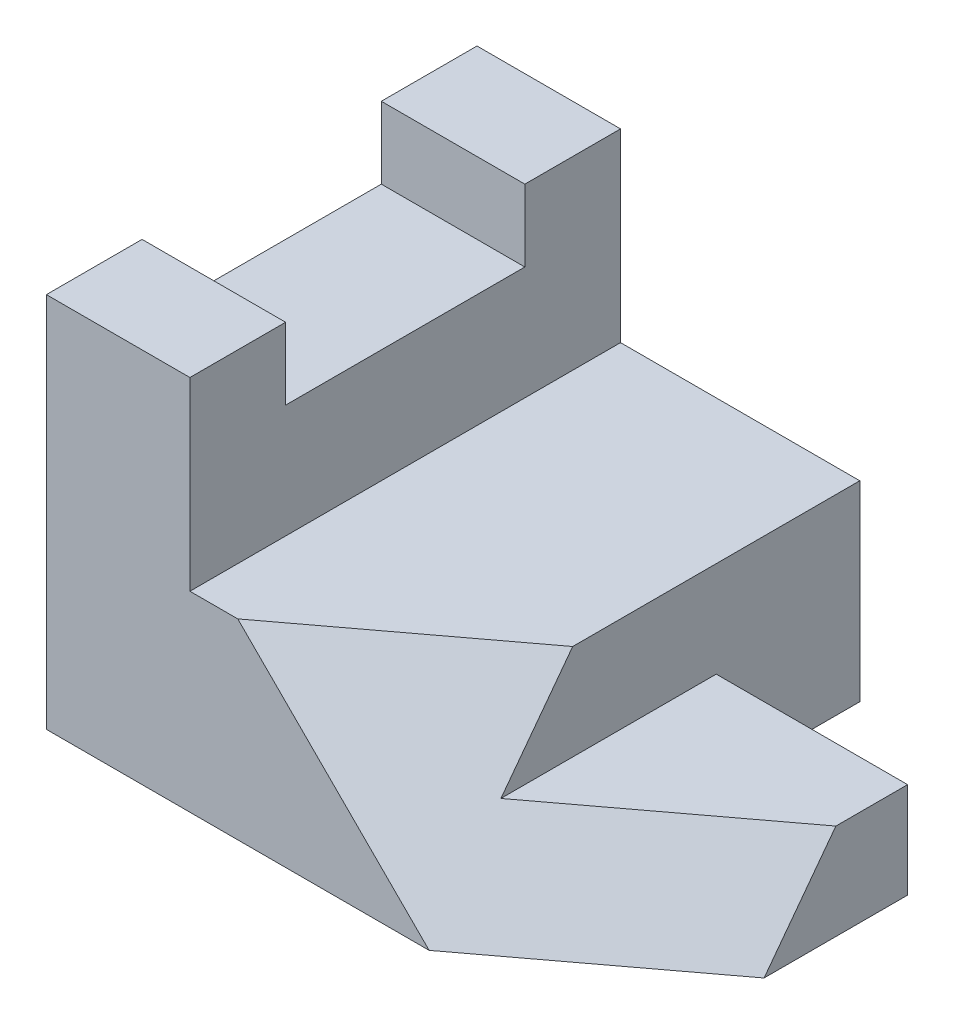
ISO-10303-21;
HEADER;
FILE_DESCRIPTION(('STEP AP214'),'2;1');
FILE_NAME('part.step','',(''),(''),'','','');
FILE_SCHEMA(('AUTOMOTIVE_DESIGN { 1 0 10303 214 1 1 1 1 }'));
ENDSEC;
DATA;
#1=APPLICATION_CONTEXT('core data for automotive mechanical design processes');
#2=APPLICATION_PROTOCOL_DEFINITION('international standard','automotive_design',2000,#1);
#3=PRODUCT_CONTEXT('',#1,'mechanical');
#4=PRODUCT('Part','Part','',(#3));
#5=PRODUCT_RELATED_PRODUCT_CATEGORY('part','',(#4));
#6=PRODUCT_DEFINITION_FORMATION('','',#4);
#7=PRODUCT_DEFINITION_CONTEXT('part definition',#1,'design');
#8=PRODUCT_DEFINITION('design','',#6,#7);
#9=PRODUCT_DEFINITION_SHAPE('','',#8);
#10=(LENGTH_UNIT() NAMED_UNIT(*) SI_UNIT(.MILLI.,.METRE.));
#11=(NAMED_UNIT(*) PLANE_ANGLE_UNIT() SI_UNIT($,.RADIAN.));
#12=(NAMED_UNIT(*) SI_UNIT($,.STERADIAN.) SOLID_ANGLE_UNIT());
#13=UNCERTAINTY_MEASURE_WITH_UNIT(LENGTH_MEASURE(1.E-05),#10,'distance_accuracy_value','');
#14=(GEOMETRIC_REPRESENTATION_CONTEXT(3) GLOBAL_UNCERTAINTY_ASSIGNED_CONTEXT((#13)) GLOBAL_UNIT_ASSIGNED_CONTEXT((#10,
#11,#12)) REPRESENTATION_CONTEXT('',''));
#15=CARTESIAN_POINT('',(0.,0.,0.));
#16=DIRECTION('',(0.,0.,1.));
#17=DIRECTION('',(1.,0.,0.));
#18=AXIS2_PLACEMENT_3D('',#15,#16,#17);
#19=CARTESIAN_POINT('',(50.8,0.,0.));
#20=DIRECTION('',(-1.,0.,0.));
#21=DIRECTION('',(0.,0.,1.));
#22=AXIS2_PLACEMENT_3D('',#19,#20,#21);
#23=PLANE('',#22);
#24=DIRECTION('',(0.,0.8,-0.6));
#25=VECTOR('',#24,1.);
#26=CARTESIAN_POINT('',(50.8,13.716,18.288));
#27=LINE('',#26,#25);
#28=CARTESIAN_POINT('',(50.8,12.7,19.05));
#29=VERTEX_POINT('',#28);
#30=CARTESIAN_POINT('',(50.8,25.4,9.52500000000004));
#31=VERTEX_POINT('',#30);
#32=EDGE_CURVE('E155',#29,#31,#27,.T.);
#33=ORIENTED_EDGE('',*,*,#32,.F.);
#34=DIRECTION('',(0.,0.,1.));
#35=VECTOR('',#34,1.);
#36=CARTESIAN_POINT('',(50.8,12.7,28.575));
#37=LINE('',#36,#35);
#38=CARTESIAN_POINT('',(50.8,12.7,-9.52500000000001));
#39=VERTEX_POINT('',#38);
#40=EDGE_CURVE('E152',#39,#29,#37,.T.);
#41=ORIENTED_EDGE('',*,*,#40,.F.);
#42=DIRECTION('',(0.,1.,0.));
#43=VECTOR('',#42,1.);
#44=CARTESIAN_POINT('',(50.8,0.,-9.52500000000001));
#45=LINE('',#44,#43);
#46=CARTESIAN_POINT('',(50.8,0.,-9.52500000000001));
#47=VERTEX_POINT('',#46);
#48=EDGE_CURVE('E165',#47,#39,#45,.T.);
#49=ORIENTED_EDGE('',*,*,#48,.F.);
#50=DIRECTION('',(0.,0.,-1.));
#51=VECTOR('',#50,1.);
#52=CARTESIAN_POINT('',(50.8,0.,-28.575));
#53=LINE('',#52,#51);
#54=CARTESIAN_POINT('',(50.8,0.,-28.575));
#55=VERTEX_POINT('',#54);
#56=EDGE_CURVE('E184',#47,#55,#53,.T.);
#57=ORIENTED_EDGE('',*,*,#56,.T.);
#58=DIRECTION('',(0.,1.,0.));
#59=VECTOR('',#58,1.);
#60=CARTESIAN_POINT('',(50.8,25.4,-28.575));
#61=LINE('',#60,#59);
#62=CARTESIAN_POINT('',(50.8,25.4,-28.575));
#63=VERTEX_POINT('',#62);
#64=EDGE_CURVE('E186',#55,#63,#61,.T.);
#65=ORIENTED_EDGE('',*,*,#64,.T.);
#66=DIRECTION('',(0.,0.,1.));
#67=VECTOR('',#66,1.);
#68=CARTESIAN_POINT('',(50.8,25.4,28.575));
#69=LINE('',#68,#67);
#70=EDGE_CURVE('E192',#63,#31,#69,.T.);
#71=ORIENTED_EDGE('',*,*,#70,.T.);
#72=EDGE_LOOP('',(#33,#41,#49,#57,#65,#71));
#73=FACE_BOUND('',#72,.T.);
#74=ADVANCED_FACE('F33',(#73),#23,.F.);
#75=CARTESIAN_POINT('',(19.05,49.9683225810123,28.575));
#76=DIRECTION('',(0.,0.,-1.));
#77=DIRECTION('',(0.,1.,0.));
#78=AXIS2_PLACEMENT_3D('',#75,#76,#77);
#79=PLANE('',#78);
#80=DIRECTION('',(0.707106781186547,-0.707106781186548,0.));
#81=VECTOR('',#80,1.);
#82=CARTESIAN_POINT('',(9.94083870949386,40.8591612905062,28.575));
#83=LINE('',#82,#81);
#84=CARTESIAN_POINT('',(25.4000000000001,25.4,28.575));
#85=VERTEX_POINT('',#84);
#86=CARTESIAN_POINT('',(50.8000000000001,0.,28.575));
#87=VERTEX_POINT('',#86);
#88=EDGE_CURVE('E159',#85,#87,#83,.T.);
#89=ORIENTED_EDGE('',*,*,#88,.F.);
#90=DIRECTION('',(-1.,0.,0.));
#91=VECTOR('',#90,1.);
#92=CARTESIAN_POINT('',(50.8,25.4,28.575));
#93=LINE('',#92,#91);
#94=CARTESIAN_POINT('',(19.05,25.4,28.575));
#95=VERTEX_POINT('',#94);
#96=EDGE_CURVE('E37',#85,#95,#93,.T.);
#97=ORIENTED_EDGE('',*,*,#96,.T.);
#98=DIRECTION('',(0.,-1.,0.));
#99=VECTOR('',#98,1.);
#100=CARTESIAN_POINT('',(19.05,49.9683225810123,28.575));
#101=LINE('',#100,#99);
#102=CARTESIAN_POINT('',(19.05,49.9683225810123,28.575));
#103=VERTEX_POINT('',#102);
#104=EDGE_CURVE('E216',#103,#95,#101,.T.);
#105=ORIENTED_EDGE('',*,*,#104,.F.);
#106=DIRECTION('',(-1.,0.,0.));
#107=VECTOR('',#106,1.);
#108=CARTESIAN_POINT('',(19.05,49.9683225810123,28.575));
#109=LINE('',#108,#107);
#110=CARTESIAN_POINT('',(0.,49.9683225810123,28.575));
#111=VERTEX_POINT('',#110);
#112=EDGE_CURVE('E43',#103,#111,#109,.T.);
#113=ORIENTED_EDGE('',*,*,#112,.T.);
#114=DIRECTION('',(0.,-1.,0.));
#115=VECTOR('',#114,1.);
#116=CARTESIAN_POINT('',(0.,49.9683225810123,28.575));
#117=LINE('',#116,#115);
#118=CARTESIAN_POINT('',(0.,0.,28.575));
#119=VERTEX_POINT('',#118);
#120=EDGE_CURVE('E210',#111,#119,#117,.T.);
#121=ORIENTED_EDGE('',*,*,#120,.T.);
#122=DIRECTION('',(-1.,0.,0.));
#123=VECTOR('',#122,1.);
#124=CARTESIAN_POINT('',(19.05,0.,28.575));
#125=LINE('',#124,#123);
#126=EDGE_CURVE('E394',#87,#119,#125,.T.);
#127=ORIENTED_EDGE('',*,*,#126,.F.);
#128=EDGE_LOOP('',(#89,#97,#105,#113,#121,#127));
#129=FACE_BOUND('',#128,.T.);
#130=ADVANCED_FACE('F214',(#129),#79,.F.);
#131=CARTESIAN_POINT('',(19.05,0.,-28.575));
#132=DIRECTION('',(0.,1.,0.));
#133=DIRECTION('',(0.,0.,1.));
#134=AXIS2_PLACEMENT_3D('',#131,#132,#133);
#135=PLANE('',#134);
#136=DIRECTION('',(0.8,0.,-0.6));
#137=VECTOR('',#136,1.);
#138=CARTESIAN_POINT('',(-94.861231383918,0.,137.820923537939));
#139=LINE('',#138,#137);
#140=CARTESIAN_POINT('',(76.2,0.,9.52500000000004));
#141=VERTEX_POINT('',#140);
#142=EDGE_CURVE('E50',#87,#141,#139,.T.);
#143=ORIENTED_EDGE('',*,*,#142,.F.);
#144=ORIENTED_EDGE('',*,*,#126,.T.);
#145=DIRECTION('',(0.,0.,-1.));
#146=VECTOR('',#145,1.);
#147=CARTESIAN_POINT('',(0.,0.,-28.575));
#148=LINE('',#147,#146);
#149=CARTESIAN_POINT('',(0.,0.,-28.575));
#150=VERTEX_POINT('',#149);
#151=EDGE_CURVE('E392',#119,#150,#148,.T.);
#152=ORIENTED_EDGE('',*,*,#151,.T.);
#153=DIRECTION('',(-1.,0.,0.));
#154=VECTOR('',#153,1.);
#155=CARTESIAN_POINT('',(19.05,0.,-28.575));
#156=LINE('',#155,#154);
#157=EDGE_CURVE('E396',#55,#150,#156,.T.);
#158=ORIENTED_EDGE('',*,*,#157,.F.);
#159=ORIENTED_EDGE('',*,*,#56,.F.);
#160=DIRECTION('',(-1.,0.,0.));
#161=VECTOR('',#160,1.);
#162=CARTESIAN_POINT('',(76.2,0.,-9.52500000000001));
#163=LINE('',#162,#161);
#164=CARTESIAN_POINT('',(76.2,0.,-9.52500000000001));
#165=VERTEX_POINT('',#164);
#166=EDGE_CURVE('E176',#165,#47,#163,.T.);
#167=ORIENTED_EDGE('',*,*,#166,.F.);
#168=DIRECTION('',(0.,0.,-1.));
#169=VECTOR('',#168,1.);
#170=CARTESIAN_POINT('',(76.2,0.,28.575));
#171=LINE('',#170,#169);
#172=EDGE_CURVE('E166',#141,#165,#171,.T.);
#173=ORIENTED_EDGE('',*,*,#172,.F.);
#174=EDGE_LOOP('',(#143,#144,#152,#158,#159,#167,#173));
#175=FACE_BOUND('',#174,.T.);
#176=ADVANCED_FACE('F225',(#175),#135,.F.);
#177=CARTESIAN_POINT('',(50.8,25.4,28.575));
#178=DIRECTION('',(0.,-1.,0.));
#179=DIRECTION('',(0.,0.,-1.));
#180=AXIS2_PLACEMENT_3D('',#177,#178,#179);
#181=PLANE('',#180);
#182=DIRECTION('',(0.8,0.,-0.6));
#183=VECTOR('',#182,1.);
#184=CARTESIAN_POINT('',(-120.261231383918,25.4,137.820923537939));
#185=LINE('',#184,#183);
#186=EDGE_CURVE('E58',#85,#31,#185,.T.);
#187=ORIENTED_EDGE('',*,*,#186,.T.);
#188=ORIENTED_EDGE('',*,*,#70,.F.);
#189=DIRECTION('',(-1.,0.,0.));
#190=VECTOR('',#189,1.);
#191=CARTESIAN_POINT('',(50.8,25.4,-28.575));
#192=LINE('',#191,#190);
#193=CARTESIAN_POINT('',(19.05,25.4,-28.575));
#194=VERTEX_POINT('',#193);
#195=EDGE_CURVE('E205',#63,#194,#192,.T.);
#196=ORIENTED_EDGE('',*,*,#195,.T.);
#197=DIRECTION('',(0.,0.,1.));
#198=VECTOR('',#197,1.);
#199=CARTESIAN_POINT('',(19.05,25.4,28.575));
#200=LINE('',#199,#198);
#201=EDGE_CURVE('E179',#194,#95,#200,.T.);
#202=ORIENTED_EDGE('',*,*,#201,.T.);
#203=ORIENTED_EDGE('',*,*,#96,.F.);
#204=EDGE_LOOP('',(#187,#188,#196,#202,#203));
#205=FACE_BOUND('',#204,.T.);
#206=ADVANCED_FACE('F223',(#205),#181,.F.);
#207=CARTESIAN_POINT('',(76.2,12.7,28.575));
#208=DIRECTION('',(0.,-1.,0.));
#209=DIRECTION('',(0.,0.,-1.));
#210=AXIS2_PLACEMENT_3D('',#207,#208,#209);
#211=PLANE('',#210);
#212=DIRECTION('',(-0.8,0.,0.6));
#213=VECTOR('',#212,1.);
#214=CARTESIAN_POINT('',(62.484,12.7,10.287));
#215=LINE('',#214,#213);
#216=CARTESIAN_POINT('',(76.2,12.7,0.));
#217=VERTEX_POINT('',#216);
#218=EDGE_CURVE('E150',#217,#29,#215,.T.);
#219=ORIENTED_EDGE('',*,*,#218,.F.);
#220=DIRECTION('',(0.,0.,1.));
#221=VECTOR('',#220,1.);
#222=CARTESIAN_POINT('',(76.2,12.7,28.575));
#223=LINE('',#222,#221);
#224=CARTESIAN_POINT('',(76.2,12.7,-9.52500000000001));
#225=VERTEX_POINT('',#224);
#226=EDGE_CURVE('E138',#225,#217,#223,.T.);
#227=ORIENTED_EDGE('',*,*,#226,.F.);
#228=DIRECTION('',(-1.,0.,0.));
#229=VECTOR('',#228,1.);
#230=CARTESIAN_POINT('',(76.2,12.7,-9.52500000000001));
#231=LINE('',#230,#229);
#232=EDGE_CURVE('E146',#225,#39,#231,.T.);
#233=ORIENTED_EDGE('',*,*,#232,.T.);
#234=ORIENTED_EDGE('',*,*,#40,.T.);
#235=EDGE_LOOP('',(#219,#227,#233,#234));
#236=FACE_BOUND('',#235,.T.);
#237=ADVANCED_FACE('F151',(#236),#211,.F.);
#238=CARTESIAN_POINT('',(76.2,0.,0.));
#239=DIRECTION('',(-1.,0.,0.));
#240=DIRECTION('',(0.,0.,1.));
#241=AXIS2_PLACEMENT_3D('',#238,#239,#240);
#242=PLANE('',#241);
#243=DIRECTION('',(0.,0.8,-0.6));
#244=VECTOR('',#243,1.);
#245=CARTESIAN_POINT('',(76.2,4.57200000000002,6.09600000000003));
#246=LINE('',#245,#244);
#247=EDGE_CURVE('E11',#141,#217,#246,.T.);
#248=ORIENTED_EDGE('',*,*,#247,.F.);
#249=ORIENTED_EDGE('',*,*,#172,.T.);
#250=DIRECTION('',(0.,1.,0.));
#251=VECTOR('',#250,1.);
#252=CARTESIAN_POINT('',(76.2,0.,-9.52500000000001));
#253=LINE('',#252,#251);
#254=EDGE_CURVE('E142',#165,#225,#253,.T.);
#255=ORIENTED_EDGE('',*,*,#254,.T.);
#256=ORIENTED_EDGE('',*,*,#226,.T.);
#257=EDGE_LOOP('',(#248,#249,#255,#256));
#258=FACE_BOUND('',#257,.T.);
#259=ADVANCED_FACE('F140',(#258),#242,.F.);
#260=CARTESIAN_POINT('',(19.05,49.9683225810123,15.875));
#261=DIRECTION('',(0.,-1.,0.));
#262=DIRECTION('',(0.,0.,-1.));
#263=AXIS2_PLACEMENT_3D('',#260,#261,#262);
#264=PLANE('',#263);
#265=DIRECTION('',(0.,0.,1.));
#266=VECTOR('',#265,1.);
#267=CARTESIAN_POINT('',(0.,49.9683225810123,15.875));
#268=LINE('',#267,#266);
#269=CARTESIAN_POINT('',(0.,49.9683225810123,15.875));
#270=VERTEX_POINT('',#269);
#271=EDGE_CURVE('E207',#270,#111,#268,.T.);
#272=ORIENTED_EDGE('',*,*,#271,.T.);
#273=ORIENTED_EDGE('',*,*,#112,.F.);
#274=DIRECTION('',(0.,0.,1.));
#275=VECTOR('',#274,1.);
#276=CARTESIAN_POINT('',(19.05,49.9683225810123,15.875));
#277=LINE('',#276,#275);
#278=CARTESIAN_POINT('',(19.05,49.9683225810123,15.875));
#279=VERTEX_POINT('',#278);
#280=EDGE_CURVE('E196',#279,#103,#277,.T.);
#281=ORIENTED_EDGE('',*,*,#280,.F.);
#282=DIRECTION('',(-1.,0.,0.));
#283=VECTOR('',#282,1.);
#284=CARTESIAN_POINT('',(19.05,49.9683225810123,15.875));
#285=LINE('',#284,#283);
#286=EDGE_CURVE('E385',#279,#270,#285,.T.);
#287=ORIENTED_EDGE('',*,*,#286,.T.);
#288=EDGE_LOOP('',(#272,#273,#281,#287));
#289=FACE_BOUND('',#288,.T.);
#290=ADVANCED_FACE('F35',(#289),#264,.F.);
#291=CARTESIAN_POINT('',(19.05,49.9683225810123,-28.575));
#292=DIRECTION('',(0.,0.,1.));
#293=DIRECTION('',(0.,-1.,0.));
#294=AXIS2_PLACEMENT_3D('',#291,#292,#293);
#295=PLANE('',#294);
#296=DIRECTION('',(0.,1.,0.));
#297=VECTOR('',#296,1.);
#298=CARTESIAN_POINT('',(0.,49.9683225810123,-28.575));
#299=LINE('',#298,#297);
#300=CARTESIAN_POINT('',(0.,49.9683225810123,-28.575));
#301=VERTEX_POINT('',#300);
#302=EDGE_CURVE('E411',#150,#301,#299,.T.);
#303=ORIENTED_EDGE('',*,*,#302,.T.);
#304=DIRECTION('',(-1.,0.,0.));
#305=VECTOR('',#304,1.);
#306=CARTESIAN_POINT('',(19.05,49.9683225810123,-28.575));
#307=LINE('',#306,#305);
#308=CARTESIAN_POINT('',(19.05,49.9683225810123,-28.575));
#309=VERTEX_POINT('',#308);
#310=EDGE_CURVE('E430',#309,#301,#307,.T.);
#311=ORIENTED_EDGE('',*,*,#310,.F.);
#312=DIRECTION('',(0.,1.,0.));
#313=VECTOR('',#312,1.);
#314=CARTESIAN_POINT('',(19.05,49.9683225810123,-28.575));
#315=LINE('',#314,#313);
#316=EDGE_CURVE('E201',#194,#309,#315,.T.);
#317=ORIENTED_EDGE('',*,*,#316,.F.);
#318=ORIENTED_EDGE('',*,*,#195,.F.);
#319=ORIENTED_EDGE('',*,*,#64,.F.);
#320=ORIENTED_EDGE('',*,*,#157,.T.);
#321=EDGE_LOOP('',(#303,#311,#317,#318,#319,#320));
#322=FACE_BOUND('',#321,.T.);
#323=ADVANCED_FACE('F300',(#322),#295,.F.);
#324=CARTESIAN_POINT('',(19.05,49.9683225810123,-15.875));
#325=DIRECTION('',(0.,-1.,0.));
#326=DIRECTION('',(0.,0.,-1.));
#327=AXIS2_PLACEMENT_3D('',#324,#325,#326);
#328=PLANE('',#327);
#329=DIRECTION('',(0.,0.,1.));
#330=VECTOR('',#329,1.);
#331=CARTESIAN_POINT('',(0.,49.9683225810123,-15.875));
#332=LINE('',#331,#330);
#333=CARTESIAN_POINT('',(0.,49.9683225810123,-15.875));
#334=VERTEX_POINT('',#333);
#335=EDGE_CURVE('E413',#301,#334,#332,.T.);
#336=ORIENTED_EDGE('',*,*,#335,.T.);
#337=DIRECTION('',(-1.,0.,0.));
#338=VECTOR('',#337,1.);
#339=CARTESIAN_POINT('',(19.05,49.9683225810123,-15.875));
#340=LINE('',#339,#338);
#341=CARTESIAN_POINT('',(19.05,49.9683225810123,-15.875));
#342=VERTEX_POINT('',#341);
#343=EDGE_CURVE('E427',#342,#334,#340,.T.);
#344=ORIENTED_EDGE('',*,*,#343,.F.);
#345=DIRECTION('',(0.,0.,1.));
#346=VECTOR('',#345,1.);
#347=CARTESIAN_POINT('',(19.05,49.9683225810123,-15.875));
#348=LINE('',#347,#346);
#349=EDGE_CURVE('E402',#309,#342,#348,.T.);
#350=ORIENTED_EDGE('',*,*,#349,.F.);
#351=ORIENTED_EDGE('',*,*,#310,.T.);
#352=EDGE_LOOP('',(#336,#344,#350,#351));
#353=FACE_BOUND('',#352,.T.);
#354=ADVANCED_FACE('F292',(#353),#328,.F.);
#355=CARTESIAN_POINT('',(19.05,40.4433225810123,-15.875));
#356=DIRECTION('',(0.,0.,-1.));
#357=DIRECTION('',(-1.,0.,0.));
#358=AXIS2_PLACEMENT_3D('',#355,#356,#357);
#359=PLANE('',#358);
#360=DIRECTION('',(0.,-1.,0.));
#361=VECTOR('',#360,1.);
#362=CARTESIAN_POINT('',(0.,40.4433225810123,-15.875));
#363=LINE('',#362,#361);
#364=CARTESIAN_POINT('',(0.,40.4433225810123,-15.875));
#365=VERTEX_POINT('',#364);
#366=EDGE_CURVE('E415',#334,#365,#363,.T.);
#367=ORIENTED_EDGE('',*,*,#366,.T.);
#368=DIRECTION('',(-1.,0.,0.));
#369=VECTOR('',#368,1.);
#370=CARTESIAN_POINT('',(19.05,40.4433225810123,-15.875));
#371=LINE('',#370,#369);
#372=CARTESIAN_POINT('',(19.05,40.4433225810123,-15.875));
#373=VERTEX_POINT('',#372);
#374=EDGE_CURVE('E424',#373,#365,#371,.T.);
#375=ORIENTED_EDGE('',*,*,#374,.F.);
#376=DIRECTION('',(0.,-1.,0.));
#377=VECTOR('',#376,1.);
#378=CARTESIAN_POINT('',(19.05,40.4433225810123,-15.875));
#379=LINE('',#378,#377);
#380=EDGE_CURVE('E404',#342,#373,#379,.T.);
#381=ORIENTED_EDGE('',*,*,#380,.F.);
#382=ORIENTED_EDGE('',*,*,#343,.T.);
#383=EDGE_LOOP('',(#367,#375,#381,#382));
#384=FACE_BOUND('',#383,.T.);
#385=ADVANCED_FACE('F284',(#384),#359,.F.);
#386=CARTESIAN_POINT('',(19.05,40.4433225810123,15.875));
#387=DIRECTION('',(0.,-1.,0.));
#388=DIRECTION('',(0.,0.,-1.));
#389=AXIS2_PLACEMENT_3D('',#386,#387,#388);
#390=PLANE('',#389);
#391=DIRECTION('',(0.,0.,1.));
#392=VECTOR('',#391,1.);
#393=CARTESIAN_POINT('',(0.,40.4433225810123,15.875));
#394=LINE('',#393,#392);
#395=CARTESIAN_POINT('',(0.,40.4433225810123,15.875));
#396=VERTEX_POINT('',#395);
#397=EDGE_CURVE('E417',#365,#396,#394,.T.);
#398=ORIENTED_EDGE('',*,*,#397,.T.);
#399=DIRECTION('',(-1.,0.,0.));
#400=VECTOR('',#399,1.);
#401=CARTESIAN_POINT('',(19.05,40.4433225810123,15.875));
#402=LINE('',#401,#400);
#403=CARTESIAN_POINT('',(19.05,40.4433225810123,15.875));
#404=VERTEX_POINT('',#403);
#405=EDGE_CURVE('E421',#404,#396,#402,.T.);
#406=ORIENTED_EDGE('',*,*,#405,.F.);
#407=DIRECTION('',(0.,0.,1.));
#408=VECTOR('',#407,1.);
#409=CARTESIAN_POINT('',(19.05,40.4433225810123,15.875));
#410=LINE('',#409,#408);
#411=EDGE_CURVE('E406',#373,#404,#410,.T.);
#412=ORIENTED_EDGE('',*,*,#411,.F.);
#413=ORIENTED_EDGE('',*,*,#374,.T.);
#414=EDGE_LOOP('',(#398,#406,#412,#413));
#415=FACE_BOUND('',#414,.T.);
#416=ADVANCED_FACE('F276',(#415),#390,.F.);
#417=CARTESIAN_POINT('',(19.05,40.4433225810123,15.875));
#418=DIRECTION('',(0.,0.,1.));
#419=DIRECTION('',(1.,0.,0.));
#420=AXIS2_PLACEMENT_3D('',#417,#418,#419);
#421=PLANE('',#420);
#422=DIRECTION('',(0.,1.,0.));
#423=VECTOR('',#422,1.);
#424=CARTESIAN_POINT('',(0.,40.4433225810123,15.875));
#425=LINE('',#424,#423);
#426=EDGE_CURVE('E388',#396,#270,#425,.T.);
#427=ORIENTED_EDGE('',*,*,#426,.T.);
#428=ORIENTED_EDGE('',*,*,#286,.F.);
#429=DIRECTION('',(0.,1.,0.));
#430=VECTOR('',#429,1.);
#431=CARTESIAN_POINT('',(19.05,40.4433225810123,15.875));
#432=LINE('',#431,#430);
#433=EDGE_CURVE('E408',#404,#279,#432,.T.);
#434=ORIENTED_EDGE('',*,*,#433,.F.);
#435=ORIENTED_EDGE('',*,*,#405,.T.);
#436=EDGE_LOOP('',(#427,#428,#434,#435));
#437=FACE_BOUND('',#436,.T.);
#438=ADVANCED_FACE('F271',(#437),#421,.F.);
#439=CARTESIAN_POINT('',(19.05,0.,0.));
#440=DIRECTION('',(1.,0.,0.));
#441=DIRECTION('',(0.,0.,-1.));
#442=AXIS2_PLACEMENT_3D('',#439,#440,#441);
#443=PLANE('',#442);
#444=ORIENTED_EDGE('',*,*,#201,.F.);
#445=ORIENTED_EDGE('',*,*,#316,.T.);
#446=ORIENTED_EDGE('',*,*,#349,.T.);
#447=ORIENTED_EDGE('',*,*,#380,.T.);
#448=ORIENTED_EDGE('',*,*,#411,.T.);
#449=ORIENTED_EDGE('',*,*,#433,.T.);
#450=ORIENTED_EDGE('',*,*,#280,.T.);
#451=ORIENTED_EDGE('',*,*,#104,.T.);
#452=EDGE_LOOP('',(#444,#445,#446,#447,#448,#449,#450,#451));
#453=FACE_BOUND('',#452,.T.);
#454=ADVANCED_FACE('F219',(#453),#443,.T.);
#455=CARTESIAN_POINT('',(0.,0.,0.));
#456=DIRECTION('',(1.,0.,0.));
#457=DIRECTION('',(0.,0.,-1.));
#458=AXIS2_PLACEMENT_3D('',#455,#456,#457);
#459=PLANE('',#458);
#460=ORIENTED_EDGE('',*,*,#271,.F.);
#461=ORIENTED_EDGE('',*,*,#426,.F.);
#462=ORIENTED_EDGE('',*,*,#397,.F.);
#463=ORIENTED_EDGE('',*,*,#366,.F.);
#464=ORIENTED_EDGE('',*,*,#335,.F.);
#465=ORIENTED_EDGE('',*,*,#302,.F.);
#466=ORIENTED_EDGE('',*,*,#151,.F.);
#467=ORIENTED_EDGE('',*,*,#120,.F.);
#468=EDGE_LOOP('',(#460,#461,#462,#463,#464,#465,#466,#467));
#469=FACE_BOUND('',#468,.T.);
#470=ADVANCED_FACE('F243',(#469),#459,.F.);
#471=CARTESIAN_POINT('',(76.2,0.,-9.52500000000001));
#472=DIRECTION('',(0.,0.,1.));
#473=DIRECTION('',(1.,0.,0.));
#474=AXIS2_PLACEMENT_3D('',#471,#472,#473);
#475=PLANE('',#474);
#476=ORIENTED_EDGE('',*,*,#48,.T.);
#477=ORIENTED_EDGE('',*,*,#232,.F.);
#478=ORIENTED_EDGE('',*,*,#254,.F.);
#479=ORIENTED_EDGE('',*,*,#166,.T.);
#480=EDGE_LOOP('',(#476,#477,#478,#479));
#481=FACE_BOUND('',#480,.T.);
#482=ADVANCED_FACE('F241',(#481),#475,.F.);
#483=CARTESIAN_POINT('',(-120.261231383918,25.4,137.820923537939));
#484=DIRECTION('',(0.514495755427527,0.514495755427527,0.685994340570035));
#485=DIRECTION('',(0.8,0.,-0.6));
#486=AXIS2_PLACEMENT_3D('',#483,#484,#485);
#487=PLANE('',#486);
#488=ORIENTED_EDGE('',*,*,#186,.F.);
#489=ORIENTED_EDGE('',*,*,#88,.T.);
#490=ORIENTED_EDGE('',*,*,#142,.T.);
#491=ORIENTED_EDGE('',*,*,#247,.T.);
#492=ORIENTED_EDGE('',*,*,#218,.T.);
#493=ORIENTED_EDGE('',*,*,#32,.T.);
#494=EDGE_LOOP('',(#488,#489,#490,#491,#492,#493));
#495=FACE_BOUND('',#494,.T.);
#496=ADVANCED_FACE('F157',(#495),#487,.T.);
#497=CLOSED_SHELL('',(#74,#130,#176,#206,#237,#259,#290,#323,#354,#385,#416,#438,#454,#470,#482,#496));
#498=MANIFOLD_SOLID_BREP('B2',#497);
#499=ADVANCED_BREP_SHAPE_REPRESENTATION('',(#18,#498),#14);
#500=SHAPE_DEFINITION_REPRESENTATION(#9,#499);
ENDSEC;
END-ISO-10303-21;
